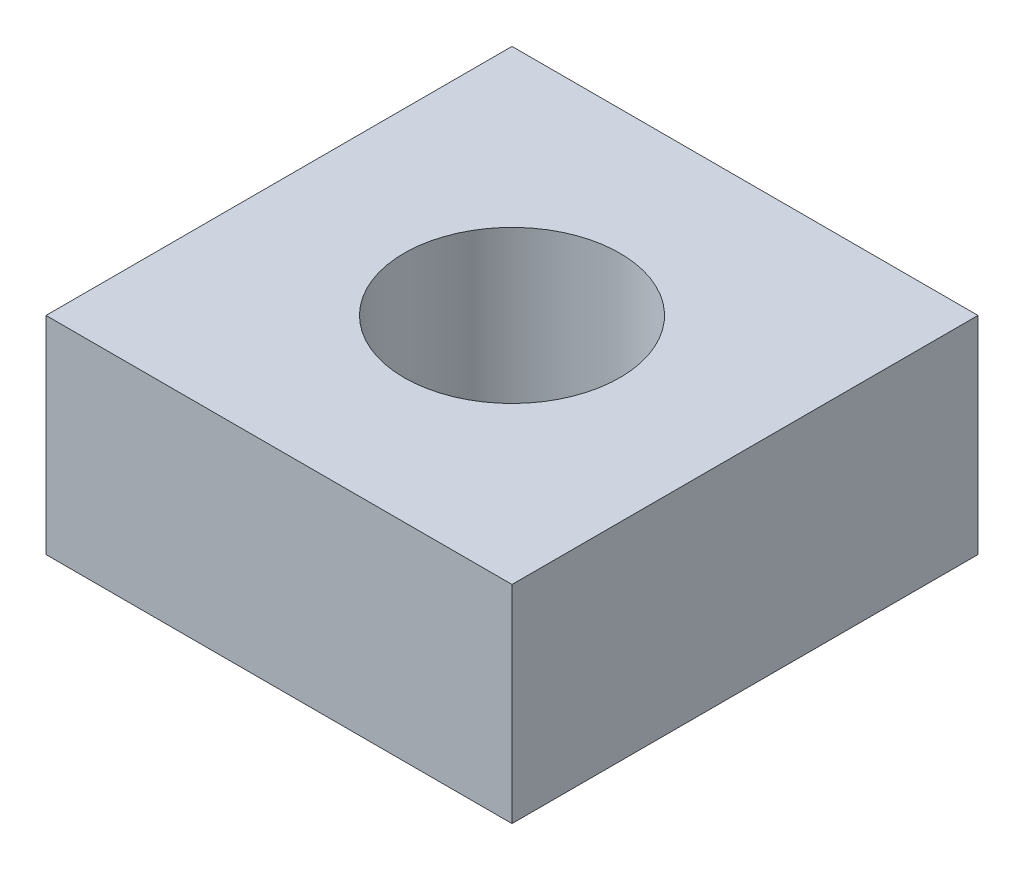
ISO-10303-21;
HEADER;
FILE_DESCRIPTION(('STEP AP214'),'2;1');
FILE_NAME('part.step','',(''),(''),'','','');
FILE_SCHEMA(('AUTOMOTIVE_DESIGN { 1 0 10303 214 1 1 1 1 }'));
ENDSEC;
DATA;
#1=APPLICATION_CONTEXT('core data for automotive mechanical design processes');
#2=APPLICATION_PROTOCOL_DEFINITION('international standard','automotive_design',2000,#1);
#3=PRODUCT_CONTEXT('',#1,'mechanical');
#4=PRODUCT('Part','Part','',(#3));
#5=PRODUCT_RELATED_PRODUCT_CATEGORY('part','',(#4));
#6=PRODUCT_DEFINITION_FORMATION('','',#4);
#7=PRODUCT_DEFINITION_CONTEXT('part definition',#1,'design');
#8=PRODUCT_DEFINITION('design','',#6,#7);
#9=PRODUCT_DEFINITION_SHAPE('','',#8);
#10=(LENGTH_UNIT() NAMED_UNIT(*) SI_UNIT(.MILLI.,.METRE.));
#11=(NAMED_UNIT(*) PLANE_ANGLE_UNIT() SI_UNIT($,.RADIAN.));
#12=(NAMED_UNIT(*) SI_UNIT($,.STERADIAN.) SOLID_ANGLE_UNIT());
#13=UNCERTAINTY_MEASURE_WITH_UNIT(LENGTH_MEASURE(1.E-05),#10,'distance_accuracy_value','');
#14=(GEOMETRIC_REPRESENTATION_CONTEXT(3) GLOBAL_UNCERTAINTY_ASSIGNED_CONTEXT((#13)) GLOBAL_UNIT_ASSIGNED_CONTEXT((#10,
#11,#12)) REPRESENTATION_CONTEXT('',''));
#15=CARTESIAN_POINT('',(0.,0.,0.));
#16=DIRECTION('',(0.,0.,1.));
#17=DIRECTION('',(1.,0.,0.));
#18=AXIS2_PLACEMENT_3D('',#15,#16,#17);
#19=CARTESIAN_POINT('',(0.,0.,0.));
#20=DIRECTION('',(0.,-1.,0.));
#21=DIRECTION('',(1.,0.,0.));
#22=AXIS2_PLACEMENT_3D('',#19,#20,#21);
#23=PLANE('',#22);
#24=DIRECTION('',(0.,0.,-1.));
#25=VECTOR('',#24,1.);
#26=CARTESIAN_POINT('',(-2.7,0.,2.7));
#27=LINE('',#26,#25);
#28=CARTESIAN_POINT('',(-2.7,0.,2.7));
#29=VERTEX_POINT('',#28);
#30=CARTESIAN_POINT('',(-2.7,0.,-2.7));
#31=VERTEX_POINT('',#30);
#32=EDGE_CURVE('E55',#29,#31,#27,.T.);
#33=ORIENTED_EDGE('',*,*,#32,.T.);
#34=DIRECTION('',(1.,0.,0.));
#35=VECTOR('',#34,1.);
#36=CARTESIAN_POINT('',(-2.7,0.,-2.7));
#37=LINE('',#36,#35);
#38=CARTESIAN_POINT('',(2.7,0.,-2.7));
#39=VERTEX_POINT('',#38);
#40=EDGE_CURVE('E91',#31,#39,#37,.T.);
#41=ORIENTED_EDGE('',*,*,#40,.T.);
#42=DIRECTION('',(0.,0.,1.));
#43=VECTOR('',#42,1.);
#44=CARTESIAN_POINT('',(2.7,0.,2.7));
#45=LINE('',#44,#43);
#46=CARTESIAN_POINT('',(2.7,0.,2.7));
#47=VERTEX_POINT('',#46);
#48=EDGE_CURVE('E60',#39,#47,#45,.T.);
#49=ORIENTED_EDGE('',*,*,#48,.T.);
#50=DIRECTION('',(-1.,0.,0.));
#51=VECTOR('',#50,1.);
#52=CARTESIAN_POINT('',(-2.7,0.,2.7));
#53=LINE('',#52,#51);
#54=EDGE_CURVE('E58',#47,#29,#53,.T.);
#55=ORIENTED_EDGE('',*,*,#54,.T.);
#56=EDGE_LOOP('',(#33,#41,#49,#55));
#57=FACE_BOUND('',#56,.T.);
#58=CARTESIAN_POINT('',(0.,0.,0.));
#59=DIRECTION('',(0.,1.,0.));
#60=DIRECTION('',(0.,0.,1.));
#61=AXIS2_PLACEMENT_3D('',#58,#59,#60);
#62=CIRCLE('',#61,1.24999999999999);
#63=CARTESIAN_POINT('',(0.,0.,1.24999999999999));
#64=VERTEX_POINT('',#63);
#65=EDGE_CURVE('E20',#64,#64,#62,.T.);
#66=ORIENTED_EDGE('',*,*,#65,.T.);
#67=EDGE_LOOP('',(#66));
#68=FACE_BOUND('',#67,.T.);
#69=ADVANCED_FACE('F17',(#57,#68),#23,.T.);
#70=CARTESIAN_POINT('',(0.,2.4,0.));
#71=DIRECTION('',(0.,1.,0.));
#72=DIRECTION('',(0.,0.,1.));
#73=AXIS2_PLACEMENT_3D('',#70,#71,#72);
#74=CYLINDRICAL_SURFACE('',#73,1.24999999999999);
#75=ORIENTED_EDGE('',*,*,#65,.F.);
#76=EDGE_LOOP('',(#75));
#77=FACE_BOUND('',#76,.T.);
#78=CARTESIAN_POINT('',(0.,2.4,0.));
#79=DIRECTION('',(0.,1.,0.));
#80=DIRECTION('',(0.,0.,1.));
#81=AXIS2_PLACEMENT_3D('',#78,#79,#80);
#82=CIRCLE('',#81,1.24999999999999);
#83=CARTESIAN_POINT('',(0.,2.4,1.24999999999999));
#84=VERTEX_POINT('',#83);
#85=EDGE_CURVE('E79',#84,#84,#82,.T.);
#86=ORIENTED_EDGE('',*,*,#85,.T.);
#87=EDGE_LOOP('',(#86));
#88=FACE_BOUND('',#87,.T.);
#89=ADVANCED_FACE('F114',(#77,#88),#74,.F.);
#90=CARTESIAN_POINT('',(-2.7,2.4,2.7));
#91=DIRECTION('',(0.,0.,-1.));
#92=DIRECTION('',(-1.,0.,0.));
#93=AXIS2_PLACEMENT_3D('',#90,#91,#92);
#94=PLANE('',#93);
#95=DIRECTION('',(0.,1.,0.));
#96=VECTOR('',#95,1.);
#97=CARTESIAN_POINT('',(2.7,2.40000000000004,2.69999999999999));
#98=LINE('',#97,#96);
#99=CARTESIAN_POINT('',(2.7,2.40000000000001,2.7));
#100=VERTEX_POINT('',#99);
#101=EDGE_CURVE('E86',#47,#100,#98,.T.);
#102=ORIENTED_EDGE('',*,*,#101,.T.);
#103=DIRECTION('',(1.,0.,0.));
#104=VECTOR('',#103,1.);
#105=CARTESIAN_POINT('',(0.,2.4,2.7));
#106=LINE('',#105,#104);
#107=CARTESIAN_POINT('',(-2.7,2.4,2.7));
#108=VERTEX_POINT('',#107);
#109=EDGE_CURVE('E76',#100,#108,#106,.F.);
#110=ORIENTED_EDGE('',*,*,#109,.T.);
#111=DIRECTION('',(0.,1.,0.));
#112=VECTOR('',#111,1.);
#113=CARTESIAN_POINT('',(-2.7,2.4,2.7));
#114=LINE('',#113,#112);
#115=EDGE_CURVE('E65',#108,#29,#114,.F.);
#116=ORIENTED_EDGE('',*,*,#115,.T.);
#117=ORIENTED_EDGE('',*,*,#54,.F.);
#118=EDGE_LOOP('',(#102,#110,#116,#117));
#119=FACE_BOUND('',#118,.T.);
#120=ADVANCED_FACE('F75',(#119),#94,.F.);
#121=CARTESIAN_POINT('',(-2.7,2.4,2.7));
#122=DIRECTION('',(1.,0.,0.));
#123=DIRECTION('',(0.,0.,-1.));
#124=AXIS2_PLACEMENT_3D('',#121,#122,#123);
#125=PLANE('',#124);
#126=ORIENTED_EDGE('',*,*,#115,.F.);
#127=DIRECTION('',(0.,0.,1.));
#128=VECTOR('',#127,1.);
#129=CARTESIAN_POINT('',(-2.7,2.4,0.));
#130=LINE('',#129,#128);
#131=CARTESIAN_POINT('',(-2.7,2.40000000000001,-2.7));
#132=VERTEX_POINT('',#131);
#133=EDGE_CURVE('E83',#108,#132,#130,.F.);
#134=ORIENTED_EDGE('',*,*,#133,.T.);
#135=DIRECTION('',(0.,1.,0.));
#136=VECTOR('',#135,1.);
#137=CARTESIAN_POINT('',(-2.7,2.4,-2.7));
#138=LINE('',#137,#136);
#139=EDGE_CURVE('E72',#132,#31,#138,.F.);
#140=ORIENTED_EDGE('',*,*,#139,.T.);
#141=ORIENTED_EDGE('',*,*,#32,.F.);
#142=EDGE_LOOP('',(#126,#134,#140,#141));
#143=FACE_BOUND('',#142,.T.);
#144=ADVANCED_FACE('F69',(#143),#125,.F.);
#145=CARTESIAN_POINT('',(-2.7,2.4,-2.7));
#146=DIRECTION('',(0.,0.,1.));
#147=DIRECTION('',(1.,0.,0.));
#148=AXIS2_PLACEMENT_3D('',#145,#146,#147);
#149=PLANE('',#148);
#150=ORIENTED_EDGE('',*,*,#139,.F.);
#151=DIRECTION('',(1.,0.,0.));
#152=VECTOR('',#151,1.);
#153=CARTESIAN_POINT('',(0.,2.4,-2.7));
#154=LINE('',#153,#152);
#155=CARTESIAN_POINT('',(2.7,2.40000000000003,-2.7));
#156=VERTEX_POINT('',#155);
#157=EDGE_CURVE('E26',#132,#156,#154,.T.);
#158=ORIENTED_EDGE('',*,*,#157,.T.);
#159=DIRECTION('',(0.,1.,0.));
#160=VECTOR('',#159,1.);
#161=CARTESIAN_POINT('',(2.7,2.40000000000004,-2.70000000000001));
#162=LINE('',#161,#160);
#163=EDGE_CURVE('E34',#156,#39,#162,.F.);
#164=ORIENTED_EDGE('',*,*,#163,.T.);
#165=ORIENTED_EDGE('',*,*,#40,.F.);
#166=EDGE_LOOP('',(#150,#158,#164,#165));
#167=FACE_BOUND('',#166,.T.);
#168=ADVANCED_FACE('F95',(#167),#149,.F.);
#169=CARTESIAN_POINT('',(2.7,2.40000000000004,2.7));
#170=DIRECTION('',(-1.,0.,0.));
#171=DIRECTION('',(0.,0.,1.));
#172=AXIS2_PLACEMENT_3D('',#169,#170,#171);
#173=PLANE('',#172);
#174=ORIENTED_EDGE('',*,*,#163,.F.);
#175=DIRECTION('',(0.,0.,1.));
#176=VECTOR('',#175,1.);
#177=CARTESIAN_POINT('',(2.7,2.4,0.));
#178=LINE('',#177,#176);
#179=EDGE_CURVE('E11',#156,#100,#178,.T.);
#180=ORIENTED_EDGE('',*,*,#179,.T.);
#181=ORIENTED_EDGE('',*,*,#101,.F.);
#182=ORIENTED_EDGE('',*,*,#48,.F.);
#183=EDGE_LOOP('',(#174,#180,#181,#182));
#184=FACE_BOUND('',#183,.T.);
#185=ADVANCED_FACE('F93',(#184),#173,.F.);
#186=CARTESIAN_POINT('',(0.,2.4,0.));
#187=DIRECTION('',(0.,-1.,0.));
#188=DIRECTION('',(1.,0.,0.));
#189=AXIS2_PLACEMENT_3D('',#186,#187,#188);
#190=PLANE('',#189);
#191=ORIENTED_EDGE('',*,*,#157,.F.);
#192=ORIENTED_EDGE('',*,*,#133,.F.);
#193=ORIENTED_EDGE('',*,*,#109,.F.);
#194=ORIENTED_EDGE('',*,*,#179,.F.);
#195=EDGE_LOOP('',(#191,#192,#193,#194));
#196=FACE_BOUND('',#195,.T.);
#197=ORIENTED_EDGE('',*,*,#85,.F.);
#198=EDGE_LOOP('',(#197));
#199=FACE_BOUND('',#198,.T.);
#200=ADVANCED_FACE('F99',(#196,#199),#190,.F.);
#201=CLOSED_SHELL('',(#69,#89,#120,#144,#168,#185,#200));
#202=MANIFOLD_SOLID_BREP('B1',#201);
#203=ADVANCED_BREP_SHAPE_REPRESENTATION('',(#18,#202),#14);
#204=SHAPE_DEFINITION_REPRESENTATION(#9,#203);
ENDSEC;
END-ISO-10303-21;
